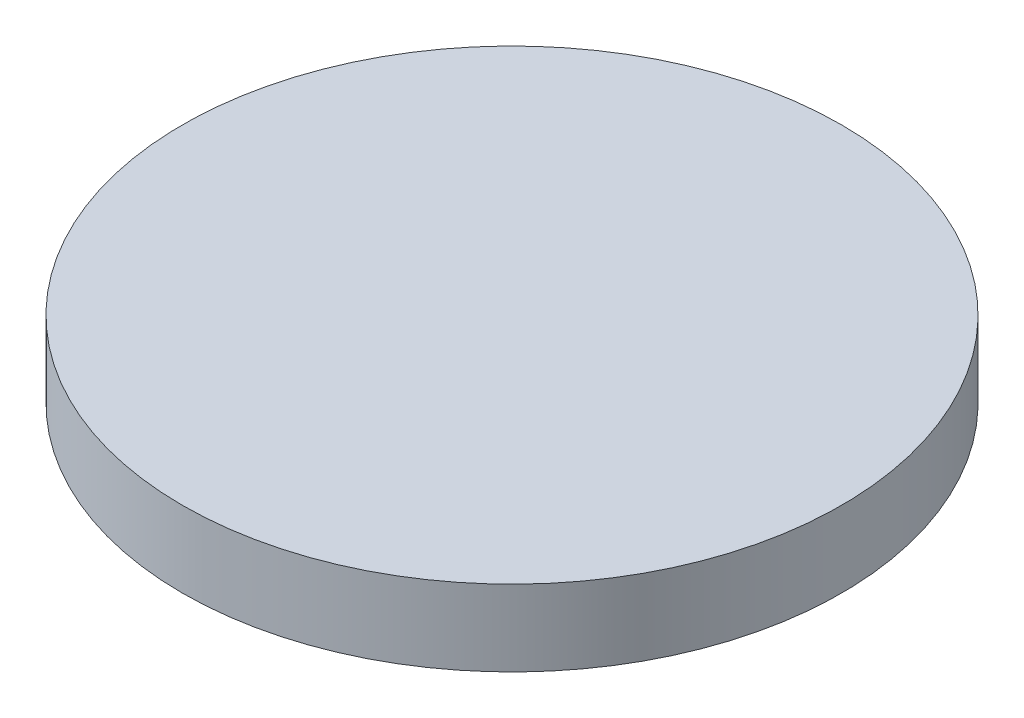
ISO-10303-21;
HEADER;
FILE_DESCRIPTION(('STEP AP214'),'2;1');
FILE_NAME('part.step','',(''),(''),'','','');
FILE_SCHEMA(('AUTOMOTIVE_DESIGN { 1 0 10303 214 1 1 1 1 }'));
ENDSEC;
DATA;
#1=APPLICATION_CONTEXT('core data for automotive mechanical design processes');
#2=APPLICATION_PROTOCOL_DEFINITION('international standard','automotive_design',2000,#1);
#3=PRODUCT_CONTEXT('',#1,'mechanical');
#4=PRODUCT('Part','Part','',(#3));
#5=PRODUCT_RELATED_PRODUCT_CATEGORY('part','',(#4));
#6=PRODUCT_DEFINITION_FORMATION('','',#4);
#7=PRODUCT_DEFINITION_CONTEXT('part definition',#1,'design');
#8=PRODUCT_DEFINITION('design','',#6,#7);
#9=PRODUCT_DEFINITION_SHAPE('','',#8);
#10=(LENGTH_UNIT() NAMED_UNIT(*) SI_UNIT(.MILLI.,.METRE.));
#11=(NAMED_UNIT(*) PLANE_ANGLE_UNIT() SI_UNIT($,.RADIAN.));
#12=(NAMED_UNIT(*) SI_UNIT($,.STERADIAN.) SOLID_ANGLE_UNIT());
#13=UNCERTAINTY_MEASURE_WITH_UNIT(LENGTH_MEASURE(1.E-05),#10,'distance_accuracy_value','');
#14=(GEOMETRIC_REPRESENTATION_CONTEXT(3) GLOBAL_UNCERTAINTY_ASSIGNED_CONTEXT((#13)) GLOBAL_UNIT_ASSIGNED_CONTEXT((#10,
#11,#12)) REPRESENTATION_CONTEXT('',''));
#15=CARTESIAN_POINT('',(0.,0.,0.));
#16=DIRECTION('',(0.,0.,1.));
#17=DIRECTION('',(1.,0.,0.));
#18=AXIS2_PLACEMENT_3D('',#15,#16,#17);
#19=CARTESIAN_POINT('',(0.,3.,0.));
#20=DIRECTION('',(0.,-1.,0.));
#21=DIRECTION('',(0.,0.,-1.));
#22=AXIS2_PLACEMENT_3D('',#19,#20,#21);
#23=CYLINDRICAL_SURFACE('',#22,13.);
#24=CARTESIAN_POINT('',(0.,3.,0.));
#25=DIRECTION('',(0.,1.,0.));
#26=DIRECTION('',(0.,0.,1.));
#27=AXIS2_PLACEMENT_3D('',#24,#25,#26);
#28=CIRCLE('',#27,13.);
#29=CARTESIAN_POINT('',(0.,3.,13.));
#30=VERTEX_POINT('',#29);
#31=EDGE_CURVE('E10',#30,#30,#28,.T.);
#32=ORIENTED_EDGE('',*,*,#31,.F.);
#33=EDGE_LOOP('',(#32));
#34=FACE_BOUND('',#33,.T.);
#35=CARTESIAN_POINT('',(0.,0.,0.));
#36=DIRECTION('',(0.,1.,0.));
#37=DIRECTION('',(0.,0.,1.));
#38=AXIS2_PLACEMENT_3D('',#35,#36,#37);
#39=CIRCLE('',#38,13.);
#40=CARTESIAN_POINT('',(0.,0.,13.));
#41=VERTEX_POINT('',#40);
#42=EDGE_CURVE('E35',#41,#41,#39,.T.);
#43=ORIENTED_EDGE('',*,*,#42,.T.);
#44=EDGE_LOOP('',(#43));
#45=FACE_BOUND('',#44,.T.);
#46=ADVANCED_FACE('F32',(#34,#45),#23,.T.);
#47=CARTESIAN_POINT('',(0.,3.,0.));
#48=DIRECTION('',(0.,1.,0.));
#49=DIRECTION('',(0.,0.,1.));
#50=AXIS2_PLACEMENT_3D('',#47,#48,#49);
#51=PLANE('',#50);
#52=ORIENTED_EDGE('',*,*,#31,.T.);
#53=EDGE_LOOP('',(#52));
#54=FACE_BOUND('',#53,.T.);
#55=ADVANCED_FACE('F47',(#54),#51,.T.);
#56=CARTESIAN_POINT('',(0.,0.,0.));
#57=DIRECTION('',(0.,1.,0.));
#58=DIRECTION('',(0.,0.,1.));
#59=AXIS2_PLACEMENT_3D('',#56,#57,#58);
#60=PLANE('',#59);
#61=ORIENTED_EDGE('',*,*,#42,.F.);
#62=EDGE_LOOP('',(#61));
#63=FACE_BOUND('',#62,.T.);
#64=ADVANCED_FACE('F45',(#63),#60,.F.);
#65=CLOSED_SHELL('',(#46,#55,#64));
#66=MANIFOLD_SOLID_BREP('B2',#65);
#67=ADVANCED_BREP_SHAPE_REPRESENTATION('',(#18,#66),#14);
#68=SHAPE_DEFINITION_REPRESENTATION(#9,#67);
ENDSEC;
END-ISO-10303-21;
